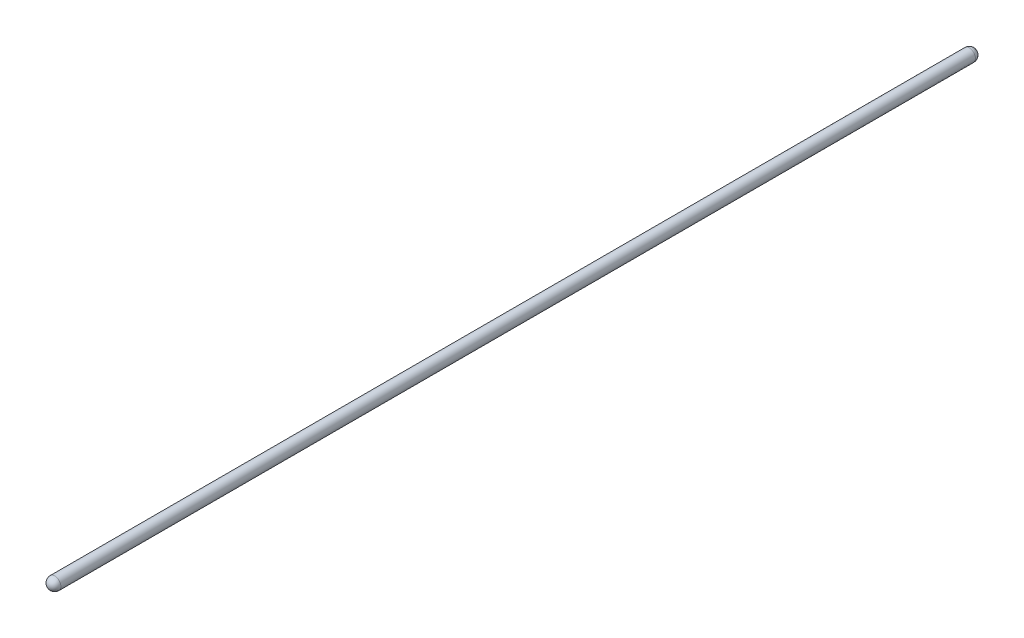
ISO-10303-21;
HEADER;
FILE_DESCRIPTION(('STEP AP214'),'2;1');
FILE_NAME('part.step','',(''),(''),'','','');
FILE_SCHEMA(('AUTOMOTIVE_DESIGN { 1 0 10303 214 1 1 1 1 }'));
ENDSEC;
DATA;
#1=APPLICATION_CONTEXT('core data for automotive mechanical design processes');
#2=APPLICATION_PROTOCOL_DEFINITION('international standard','automotive_design',2000,#1);
#3=PRODUCT_CONTEXT('',#1,'mechanical');
#4=PRODUCT('Part','Part','',(#3));
#5=PRODUCT_RELATED_PRODUCT_CATEGORY('part','',(#4));
#6=PRODUCT_DEFINITION_FORMATION('','',#4);
#7=PRODUCT_DEFINITION_CONTEXT('part definition',#1,'design');
#8=PRODUCT_DEFINITION('design','',#6,#7);
#9=PRODUCT_DEFINITION_SHAPE('','',#8);
#10=(LENGTH_UNIT() NAMED_UNIT(*) SI_UNIT(.MILLI.,.METRE.));
#11=(NAMED_UNIT(*) PLANE_ANGLE_UNIT() SI_UNIT($,.RADIAN.));
#12=(NAMED_UNIT(*) SI_UNIT($,.STERADIAN.) SOLID_ANGLE_UNIT());
#13=UNCERTAINTY_MEASURE_WITH_UNIT(LENGTH_MEASURE(1.E-05),#10,'distance_accuracy_value','');
#14=(GEOMETRIC_REPRESENTATION_CONTEXT(3) GLOBAL_UNCERTAINTY_ASSIGNED_CONTEXT((#13)) GLOBAL_UNIT_ASSIGNED_CONTEXT((#10,
#11,#12)) REPRESENTATION_CONTEXT('',''));
#15=CARTESIAN_POINT('',(0.,0.,0.));
#16=DIRECTION('',(0.,0.,1.));
#17=DIRECTION('',(1.,0.,0.));
#18=AXIS2_PLACEMENT_3D('',#15,#16,#17);
#19=CARTESIAN_POINT('',(0.,0.,0.));
#20=DIRECTION('',(0.,0.,-1.));
#21=DIRECTION('',(1.,0.,0.));
#22=AXIS2_PLACEMENT_3D('',#19,#20,#21);
#23=SPHERICAL_SURFACE('',#22,9.525);
#24=CARTESIAN_POINT('',(0.,0.,0.));
#25=DIRECTION('',(0.,0.,-1.));
#26=DIRECTION('',(-1.,0.,0.));
#27=AXIS2_PLACEMENT_3D('',#24,#25,#26);
#28=CIRCLE('',#27,9.525);
#29=CARTESIAN_POINT('',(-9.525,0.,0.));
#30=VERTEX_POINT('',#29);
#31=EDGE_CURVE('E10',#30,#30,#28,.T.);
#32=ORIENTED_EDGE('',*,*,#31,.T.);
#33=EDGE_LOOP('',(#32));
#34=FACE_BOUND('',#33,.T.);
#35=ADVANCED_FACE('F31',(#34),#23,.T.);
#36=CARTESIAN_POINT('',(0.,0.,-9.525));
#37=DIRECTION('',(0.,0.,-1.));
#38=DIRECTION('',(-1.,0.,0.));
#39=AXIS2_PLACEMENT_3D('',#36,#37,#38);
#40=CYLINDRICAL_SURFACE('',#39,9.52500000000001);
#41=ORIENTED_EDGE('',*,*,#31,.F.);
#42=EDGE_LOOP('',(#41));
#43=FACE_BOUND('',#42,.T.);
#44=CARTESIAN_POINT('',(1.74052694870573E-13,0.,1411.72311));
#45=DIRECTION('',(0.,0.,-1.));
#46=DIRECTION('',(-1.,0.,0.));
#47=AXIS2_PLACEMENT_3D('',#44,#45,#46);
#48=CIRCLE('',#47,9.52500000000003);
#49=CARTESIAN_POINT('',(-9.52499999999985,0.,1411.72311));
#50=VERTEX_POINT('',#49);
#51=EDGE_CURVE('E37',#50,#50,#48,.T.);
#52=ORIENTED_EDGE('',*,*,#51,.T.);
#53=EDGE_LOOP('',(#52));
#54=FACE_BOUND('',#53,.T.);
#55=ADVANCED_FACE('F43',(#43,#54),#40,.T.);
#56=CARTESIAN_POINT('',(0.,0.,1411.72311));
#57=DIRECTION('',(0.,0.,-1.));
#58=DIRECTION('',(1.,0.,0.));
#59=AXIS2_PLACEMENT_3D('',#56,#57,#58);
#60=SPHERICAL_SURFACE('',#59,9.5250000000002);
#61=ORIENTED_EDGE('',*,*,#51,.F.);
#62=EDGE_LOOP('',(#61));
#63=FACE_BOUND('',#62,.T.);
#64=ADVANCED_FACE('F45',(#63),#60,.T.);
#65=CLOSED_SHELL('',(#35,#55,#64));
#66=MANIFOLD_SOLID_BREP('B2',#65);
#67=ADVANCED_BREP_SHAPE_REPRESENTATION('',(#18,#66),#14);
#68=SHAPE_DEFINITION_REPRESENTATION(#9,#67);
ENDSEC;
END-ISO-10303-21;
